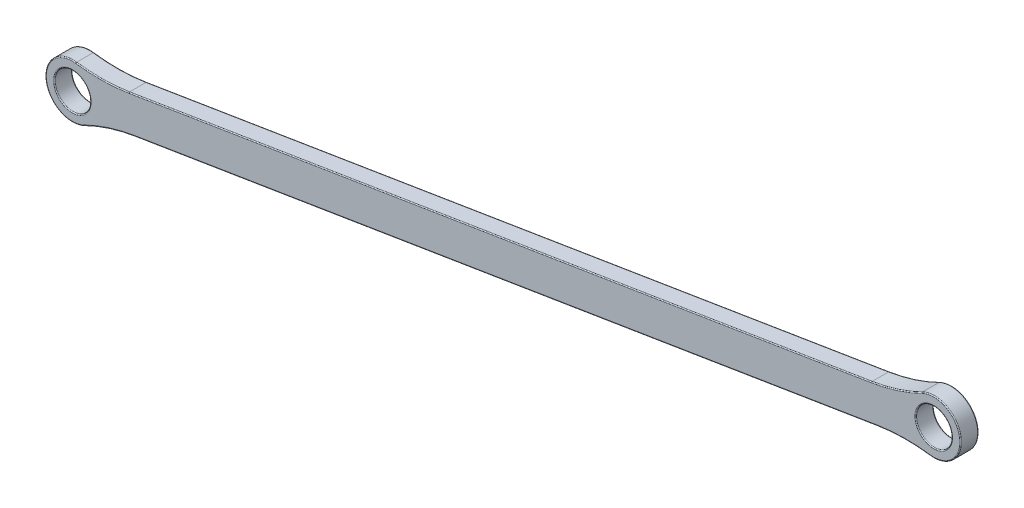
ISO-10303-21;
HEADER;
FILE_DESCRIPTION(('STEP AP214'),'2;1');
FILE_NAME('part.step','',(''),(''),'','','');
FILE_SCHEMA(('AUTOMOTIVE_DESIGN { 1 0 10303 214 1 1 1 1 }'));
ENDSEC;
DATA;
#1=APPLICATION_CONTEXT('core data for automotive mechanical design processes');
#2=APPLICATION_PROTOCOL_DEFINITION('international standard','automotive_design',2000,#1);
#3=PRODUCT_CONTEXT('',#1,'mechanical');
#4=PRODUCT('Part','Part','',(#3));
#5=PRODUCT_RELATED_PRODUCT_CATEGORY('part','',(#4));
#6=PRODUCT_DEFINITION_FORMATION('','',#4);
#7=PRODUCT_DEFINITION_CONTEXT('part definition',#1,'design');
#8=PRODUCT_DEFINITION('design','',#6,#7);
#9=PRODUCT_DEFINITION_SHAPE('','',#8);
#10=(LENGTH_UNIT() NAMED_UNIT(*) SI_UNIT(.MILLI.,.METRE.));
#11=(NAMED_UNIT(*) PLANE_ANGLE_UNIT() SI_UNIT($,.RADIAN.));
#12=(NAMED_UNIT(*) SI_UNIT($,.STERADIAN.) SOLID_ANGLE_UNIT());
#13=UNCERTAINTY_MEASURE_WITH_UNIT(LENGTH_MEASURE(1.E-05),#10,'distance_accuracy_value','');
#14=(GEOMETRIC_REPRESENTATION_CONTEXT(3) GLOBAL_UNCERTAINTY_ASSIGNED_CONTEXT((#13)) GLOBAL_UNIT_ASSIGNED_CONTEXT((#10,
#11,#12)) REPRESENTATION_CONTEXT('',''));
#15=CARTESIAN_POINT('',(0.,0.,0.));
#16=DIRECTION('',(0.,0.,1.));
#17=DIRECTION('',(1.,0.,0.));
#18=AXIS2_PLACEMENT_3D('',#15,#16,#17);
#19=CARTESIAN_POINT('',(-230.903241516904,202.906659724534,-3.));
#20=DIRECTION('',(0.,0.,1.));
#21=DIRECTION('',(1.,0.,0.));
#22=AXIS2_PLACEMENT_3D('',#19,#20,#21);
#23=CYLINDRICAL_SURFACE('',#22,4.49999999999999);
#24=DIRECTION('',(0.,0.,1.));
#25=VECTOR('',#24,1.);
#26=CARTESIAN_POINT('',(-230.297629891153,207.365721796175,-3.));
#27=LINE('',#26,#25);
#28=CARTESIAN_POINT('',(-230.297629891153,207.365721796175,-0.15));
#29=VERTEX_POINT('',#28);
#30=CARTESIAN_POINT('',(-230.297629891153,207.365721796175,-2.85));
#31=VERTEX_POINT('',#30);
#32=EDGE_CURVE('E305',#29,#31,#27,.F.);
#33=ORIENTED_EDGE('',*,*,#32,.T.);
#34=CARTESIAN_POINT('',(-230.903241516904,202.906659724534,-2.85));
#35=DIRECTION('',(0.,0.,1.));
#36=DIRECTION('',(1.,0.,0.));
#37=AXIS2_PLACEMENT_3D('',#34,#35,#36);
#38=CIRCLE('',#37,4.49999999999999);
#39=CARTESIAN_POINT('',(-228.9178396338,198.868321036092,-2.85));
#40=VERTEX_POINT('',#39);
#41=EDGE_CURVE('E220',#31,#40,#38,.T.);
#42=ORIENTED_EDGE('',*,*,#41,.T.);
#43=DIRECTION('',(0.,0.,1.));
#44=VECTOR('',#43,1.);
#45=CARTESIAN_POINT('',(-228.9178396338,198.868321036092,-3.));
#46=LINE('',#45,#44);
#47=CARTESIAN_POINT('',(-228.9178396338,198.868321036092,-0.15));
#48=VERTEX_POINT('',#47);
#49=EDGE_CURVE('E299',#40,#48,#46,.T.);
#50=ORIENTED_EDGE('',*,*,#49,.T.);
#51=CARTESIAN_POINT('',(-230.903241516904,202.906659724534,-0.15));
#52=DIRECTION('',(0.,0.,1.));
#53=DIRECTION('',(1.,0.,0.));
#54=AXIS2_PLACEMENT_3D('',#51,#52,#53);
#55=CIRCLE('',#54,4.49999999999999);
#56=EDGE_CURVE('E218',#48,#29,#55,.F.);
#57=ORIENTED_EDGE('',*,*,#56,.T.);
#58=EDGE_LOOP('',(#33,#42,#50,#57));
#59=FACE_BOUND('',#58,.T.);
#60=ADVANCED_FACE('F34',(#59),#23,.T.);
#61=CARTESIAN_POINT('',(-38.5137304043666,237.185760855667,-3.));
#62=DIRECTION('',(0.16027866625828,-0.987071805464256,0.));
#63=DIRECTION('',(0.987071805464256,0.16027866625828,0.));
#64=AXIS2_PLACEMENT_3D('',#61,#62,#63);
#65=PLANE('',#64);
#66=DIRECTION('',(0.,0.,1.));
#67=VECTOR('',#66,1.);
#68=CARTESIAN_POINT('',(-97.2038123685089,227.655787445701,-3.));
#69=LINE('',#68,#67);
#70=CARTESIAN_POINT('',(-97.2038123685089,227.655787445701,-0.15));
#71=VERTEX_POINT('',#70);
#72=CARTESIAN_POINT('',(-97.2038123685089,227.655787445701,-2.85));
#73=VERTEX_POINT('',#72);
#74=EDGE_CURVE('E333',#71,#73,#69,.F.);
#75=ORIENTED_EDGE('',*,*,#74,.T.);
#76=DIRECTION('',(0.987071805464256,0.16027866625828,0.));
#77=VECTOR('',#76,1.);
#78=CARTESIAN_POINT('',(-38.5137304043666,237.185760855667,-2.85));
#79=LINE('',#78,#77);
#80=CARTESIAN_POINT('',(-221.451859065067,207.480648109861,-2.85));
#81=VERTEX_POINT('',#80);
#82=EDGE_CURVE('E212',#73,#81,#79,.F.);
#83=ORIENTED_EDGE('',*,*,#82,.T.);
#84=DIRECTION('',(0.,0.,1.));
#85=VECTOR('',#84,1.);
#86=CARTESIAN_POINT('',(-221.451859065067,207.480648109861,-3.));
#87=LINE('',#86,#85);
#88=CARTESIAN_POINT('',(-221.451859065067,207.480648109861,-0.15));
#89=VERTEX_POINT('',#88);
#90=EDGE_CURVE('E336',#81,#89,#87,.T.);
#91=ORIENTED_EDGE('',*,*,#90,.T.);
#92=DIRECTION('',(0.987071805464256,0.16027866625828,0.));
#93=VECTOR('',#92,1.);
#94=CARTESIAN_POINT('',(-97.203812368509,227.655787445701,-0.15));
#95=LINE('',#94,#93);
#96=EDGE_CURVE('E210',#89,#71,#95,.T.);
#97=ORIENTED_EDGE('',*,*,#96,.T.);
#98=EDGE_LOOP('',(#75,#83,#91,#97));
#99=FACE_BOUND('',#98,.T.);
#100=ADVANCED_FACE('F367',(#99),#65,.F.);
#101=CARTESIAN_POINT('',(-86.7907579191226,226.307344998242,-3.));
#102=DIRECTION('',(0.,0.,1.));
#103=DIRECTION('',(1.,0.,0.));
#104=AXIS2_PLACEMENT_3D('',#101,#102,#103);
#105=CYLINDRICAL_SURFACE('',#104,4.50000000000001);
#106=DIRECTION('',(0.,0.,1.));
#107=VECTOR('',#106,1.);
#108=CARTESIAN_POINT('',(-87.3963695448733,221.8482829266,-3.));
#109=LINE('',#108,#107);
#110=CARTESIAN_POINT('',(-87.3963695448733,221.8482829266,-0.15));
#111=VERTEX_POINT('',#110);
#112=CARTESIAN_POINT('',(-87.3963695448733,221.8482829266,-2.85));
#113=VERTEX_POINT('',#112);
#114=EDGE_CURVE('E261',#111,#113,#109,.F.);
#115=ORIENTED_EDGE('',*,*,#114,.T.);
#116=CARTESIAN_POINT('',(-86.7907579191226,226.307344998242,-2.85));
#117=DIRECTION('',(0.,0.,1.));
#118=DIRECTION('',(1.,0.,0.));
#119=AXIS2_PLACEMENT_3D('',#116,#117,#118);
#120=CIRCLE('',#119,4.50000000000001);
#121=CARTESIAN_POINT('',(-88.7761598022272,230.345683686684,-2.85));
#122=VERTEX_POINT('',#121);
#123=EDGE_CURVE('E203',#113,#122,#120,.T.);
#124=ORIENTED_EDGE('',*,*,#123,.T.);
#125=DIRECTION('',(0.,0.,1.));
#126=VECTOR('',#125,1.);
#127=CARTESIAN_POINT('',(-88.7761598022272,230.345683686684,-3.));
#128=LINE('',#127,#126);
#129=CARTESIAN_POINT('',(-88.7761598022272,230.345683686684,-0.15));
#130=VERTEX_POINT('',#129);
#131=EDGE_CURVE('E341',#122,#130,#128,.T.);
#132=ORIENTED_EDGE('',*,*,#131,.T.);
#133=CARTESIAN_POINT('',(-86.7907579191226,226.307344998242,-0.15));
#134=DIRECTION('',(0.,0.,1.));
#135=DIRECTION('',(1.,0.,0.));
#136=AXIS2_PLACEMENT_3D('',#133,#134,#135);
#137=CIRCLE('',#136,4.50000000000001);
#138=EDGE_CURVE('E201',#130,#111,#137,.F.);
#139=ORIENTED_EDGE('',*,*,#138,.T.);
#140=EDGE_LOOP('',(#115,#124,#132,#139));
#141=FACE_BOUND('',#140,.T.);
#142=ADVANCED_FACE('F348',(#141),#105,.T.);
#143=CARTESIAN_POINT('',(-37.5520584068169,231.263330022882,-3.));
#144=DIRECTION('',(0.16027866625828,-0.987071805464256,0.));
#145=DIRECTION('',(0.987071805464256,0.16027866625828,0.));
#146=AXIS2_PLACEMENT_3D('',#143,#144,#145);
#147=PLANE('',#146);
#148=DIRECTION('',(0.,0.,-1.));
#149=VECTOR('',#148,1.);
#150=CARTESIAN_POINT('',(-220.490187067517,201.558217277075,-3.));
#151=LINE('',#150,#149);
#152=CARTESIAN_POINT('',(-220.490187067517,201.558217277075,-0.15));
#153=VERTEX_POINT('',#152);
#154=CARTESIAN_POINT('',(-220.490187067517,201.558217277075,-2.85));
#155=VERTEX_POINT('',#154);
#156=EDGE_CURVE('E301',#153,#155,#151,.T.);
#157=ORIENTED_EDGE('',*,*,#156,.T.);
#158=DIRECTION('',(0.987071805464256,0.16027866625828,0.));
#159=VECTOR('',#158,1.);
#160=CARTESIAN_POINT('',(-96.2421403709596,221.733356612915,-2.85));
#161=LINE('',#160,#159);
#162=CARTESIAN_POINT('',(-96.2421403709596,221.733356612915,-2.85));
#163=VERTEX_POINT('',#162);
#164=EDGE_CURVE('E195',#155,#163,#161,.T.);
#165=ORIENTED_EDGE('',*,*,#164,.T.);
#166=DIRECTION('',(0.,0.,-1.));
#167=VECTOR('',#166,1.);
#168=CARTESIAN_POINT('',(-96.2421403709596,221.733356612915,0.));
#169=LINE('',#168,#167);
#170=CARTESIAN_POINT('',(-96.2421403709596,221.733356612915,-0.15));
#171=VERTEX_POINT('',#170);
#172=EDGE_CURVE('E309',#163,#171,#169,.F.);
#173=ORIENTED_EDGE('',*,*,#172,.T.);
#174=DIRECTION('',(0.987071805464256,0.16027866625828,0.));
#175=VECTOR('',#174,1.);
#176=CARTESIAN_POINT('',(-37.5520584068169,231.263330022882,-0.15));
#177=LINE('',#176,#175);
#178=EDGE_CURVE('E193',#171,#153,#177,.F.);
#179=ORIENTED_EDGE('',*,*,#178,.T.);
#180=EDGE_LOOP('',(#157,#165,#173,#179));
#181=FACE_BOUND('',#180,.T.);
#182=ADVANCED_FACE('F332',(#181),#147,.T.);
#183=CARTESIAN_POINT('',(-86.7907579191226,226.307344998242,-3.));
#184=DIRECTION('',(0.,0.,1.));
#185=DIRECTION('',(1.,0.,0.));
#186=AXIS2_PLACEMENT_3D('',#183,#184,#185);
#187=CYLINDRICAL_SURFACE('',#186,3.00000000000005);
#188=CARTESIAN_POINT('',(-86.7907579191226,226.307344998242,-2.85));
#189=DIRECTION('',(0.,0.,1.));
#190=DIRECTION('',(1.,0.,0.));
#191=AXIS2_PLACEMENT_3D('',#188,#189,#190);
#192=CIRCLE('',#191,3.00000000000005);
#193=CARTESIAN_POINT('',(-83.7907579191226,226.307344998242,-2.85));
#194=VERTEX_POINT('',#193);
#195=EDGE_CURVE('E225',#194,#194,#192,.F.);
#196=ORIENTED_EDGE('',*,*,#195,.T.);
#197=EDGE_LOOP('',(#196));
#198=FACE_BOUND('',#197,.T.);
#199=CARTESIAN_POINT('',(-86.7907579191226,226.307344998242,-0.15));
#200=DIRECTION('',(0.,0.,1.));
#201=DIRECTION('',(1.,0.,0.));
#202=AXIS2_PLACEMENT_3D('',#199,#200,#201);
#203=CIRCLE('',#202,3.00000000000005);
#204=CARTESIAN_POINT('',(-83.7907579191226,226.307344998242,-0.15));
#205=VERTEX_POINT('',#204);
#206=EDGE_CURVE('E222',#205,#205,#203,.T.);
#207=ORIENTED_EDGE('',*,*,#206,.T.);
#208=EDGE_LOOP('',(#207));
#209=FACE_BOUND('',#208,.T.);
#210=ADVANCED_FACE('F402',(#198,#209),#187,.F.);
#211=CARTESIAN_POINT('',(-230.903241516904,202.906659724534,-3.));
#212=DIRECTION('',(0.,0.,1.));
#213=DIRECTION('',(1.,0.,0.));
#214=AXIS2_PLACEMENT_3D('',#211,#212,#213);
#215=CYLINDRICAL_SURFACE('',#214,3.00000000000004);
#216=CARTESIAN_POINT('',(-230.903241516904,202.906659724534,-2.85));
#217=DIRECTION('',(0.,0.,1.));
#218=DIRECTION('',(1.,0.,0.));
#219=AXIS2_PLACEMENT_3D('',#216,#217,#218);
#220=CIRCLE('',#219,3.00000000000004);
#221=CARTESIAN_POINT('',(-227.903241516904,202.906659724534,-2.85));
#222=VERTEX_POINT('',#221);
#223=EDGE_CURVE('E187',#222,#222,#220,.F.);
#224=ORIENTED_EDGE('',*,*,#223,.T.);
#225=EDGE_LOOP('',(#224));
#226=FACE_BOUND('',#225,.T.);
#227=CARTESIAN_POINT('',(-230.903241516904,202.906659724534,-0.15));
#228=DIRECTION('',(0.,0.,1.));
#229=DIRECTION('',(1.,0.,0.));
#230=AXIS2_PLACEMENT_3D('',#227,#228,#229);
#231=CIRCLE('',#230,3.00000000000004);
#232=CARTESIAN_POINT('',(-227.903241516904,202.906659724534,-0.15));
#233=VERTEX_POINT('',#232);
#234=EDGE_CURVE('E179',#233,#233,#231,.T.);
#235=ORIENTED_EDGE('',*,*,#234,.T.);
#236=EDGE_LOOP('',(#235));
#237=FACE_BOUND('',#236,.T.);
#238=ADVANCED_FACE('F404',(#226,#237),#215,.F.);
#239=CARTESIAN_POINT('',(0.,0.,-3.));
#240=DIRECTION('',(0.,0.,1.));
#241=DIRECTION('',(1.,0.,0.));
#242=AXIS2_PLACEMENT_3D('',#239,#240,#241);
#243=PLANE('',#242);
#244=CARTESIAN_POINT('',(-230.903241516904,202.906659724534,-3.));
#245=DIRECTION('',(0.,0.,1.));
#246=DIRECTION('',(1.,0.,0.));
#247=AXIS2_PLACEMENT_3D('',#244,#245,#246);
#248=CIRCLE('',#247,3.15000000000004);
#249=CARTESIAN_POINT('',(-227.753241516904,202.906659724534,-3.));
#250=VERTEX_POINT('',#249);
#251=EDGE_CURVE('E176',#250,#250,#248,.T.);
#252=ORIENTED_EDGE('',*,*,#251,.T.);
#253=EDGE_LOOP('',(#252));
#254=FACE_BOUND('',#253,.T.);
#255=DIRECTION('',(0.987071805464256,0.16027866625828,0.));
#256=VECTOR('',#255,1.);
#257=CARTESIAN_POINT('',(-220.514228867456,201.706278047895,-3.));
#258=LINE('',#257,#256);
#259=CARTESIAN_POINT('',(-96.2661821708984,221.881417383735,-3.));
#260=VERTEX_POINT('',#259);
#261=CARTESIAN_POINT('',(-220.514228867456,201.706278047895,-3.));
#262=VERTEX_POINT('',#261);
#263=EDGE_CURVE('E174',#260,#262,#258,.F.);
#264=ORIENTED_EDGE('',*,*,#263,.T.);
#265=CARTESIAN_POINT('',(-215.681827079769,171.946063113147,-3.));
#266=DIRECTION('',(0.,0.,1.));
#267=DIRECTION('',(1.,0.,0.));
#268=AXIS2_PLACEMENT_3D('',#265,#266,#267);
#269=CIRCLE('',#268,30.15);
#270=CARTESIAN_POINT('',(-228.98401969657,199.002932325707,-3.));
#271=VERTEX_POINT('',#270);
#272=EDGE_CURVE('E154',#262,#271,#269,.T.);
#273=ORIENTED_EDGE('',*,*,#272,.T.);
#274=CARTESIAN_POINT('',(-230.903241516904,202.906659724534,-3.));
#275=DIRECTION('',(0.,0.,1.));
#276=DIRECTION('',(1.,0.,0.));
#277=AXIS2_PLACEMENT_3D('',#274,#275,#276);
#278=CIRCLE('',#277,4.34999999999999);
#279=CARTESIAN_POINT('',(-230.317816945345,207.217086393787,-3.));
#280=VERTEX_POINT('',#279);
#281=EDGE_CURVE('E162',#271,#280,#278,.F.);
#282=ORIENTED_EDGE('',*,*,#281,.T.);
#283=CARTESIAN_POINT('',(-226.260219052816,237.092802273788,-3.));
#284=DIRECTION('',(0.,0.,1.));
#285=DIRECTION('',(1.,0.,0.));
#286=AXIS2_PLACEMENT_3D('',#283,#284,#285);
#287=CIRCLE('',#286,30.15);
#288=CARTESIAN_POINT('',(-221.427817265129,207.332587339041,-3.));
#289=VERTEX_POINT('',#288);
#290=EDGE_CURVE('E168',#280,#289,#287,.T.);
#291=ORIENTED_EDGE('',*,*,#290,.T.);
#292=DIRECTION('',(0.987071805464256,0.16027866625828,0.));
#293=VECTOR('',#292,1.);
#294=CARTESIAN_POINT('',(-38.4896886044279,237.037700084848,-3.));
#295=LINE('',#294,#293);
#296=CARTESIAN_POINT('',(-97.1797705685702,227.507726674881,-3.));
#297=VERTEX_POINT('',#296);
#298=EDGE_CURVE('E314',#289,#297,#295,.T.);
#299=ORIENTED_EDGE('',*,*,#298,.T.);
#300=CARTESIAN_POINT('',(-102.012172356257,257.267941609629,-3.));
#301=DIRECTION('',(0.,0.,1.));
#302=DIRECTION('',(1.,0.,0.));
#303=AXIS2_PLACEMENT_3D('',#300,#301,#302);
#304=CIRCLE('',#303,30.15);
#305=CARTESIAN_POINT('',(-88.709979739457,230.211072397069,-3.));
#306=VERTEX_POINT('',#305);
#307=EDGE_CURVE('E316',#297,#306,#304,.T.);
#308=ORIENTED_EDGE('',*,*,#307,.T.);
#309=CARTESIAN_POINT('',(-86.7907579191226,226.307344998242,-3.));
#310=DIRECTION('',(0.,0.,1.));
#311=DIRECTION('',(1.,0.,0.));
#312=AXIS2_PLACEMENT_3D('',#309,#310,#311);
#313=CIRCLE('',#312,4.35000000000001);
#314=CARTESIAN_POINT('',(-87.3761824906816,221.996918328989,-3.));
#315=VERTEX_POINT('',#314);
#316=EDGE_CURVE('E318',#306,#315,#313,.F.);
#317=ORIENTED_EDGE('',*,*,#316,.T.);
#318=CARTESIAN_POINT('',(-91.4337803832112,192.121202448988,-3.));
#319=DIRECTION('',(0.,0.,1.));
#320=DIRECTION('',(1.,0.,0.));
#321=AXIS2_PLACEMENT_3D('',#318,#319,#320);
#322=CIRCLE('',#321,30.15);
#323=EDGE_CURVE('E181',#315,#260,#322,.T.);
#324=ORIENTED_EDGE('',*,*,#323,.T.);
#325=EDGE_LOOP('',(#264,#273,#282,#291,#299,#308,#317,#324));
#326=FACE_BOUND('',#325,.T.);
#327=CARTESIAN_POINT('',(-86.7907579191226,226.307344998242,-3.));
#328=DIRECTION('',(0.,0.,1.));
#329=DIRECTION('',(1.,0.,0.));
#330=AXIS2_PLACEMENT_3D('',#327,#328,#329);
#331=CIRCLE('',#330,3.15000000000005);
#332=CARTESIAN_POINT('',(-83.6407579191226,226.307344998242,-3.));
#333=VERTEX_POINT('',#332);
#334=EDGE_CURVE('E169',#333,#333,#331,.T.);
#335=ORIENTED_EDGE('',*,*,#334,.T.);
#336=EDGE_LOOP('',(#335));
#337=FACE_BOUND('',#336,.T.);
#338=ADVANCED_FACE('F171',(#254,#326,#337),#243,.F.);
#339=CARTESIAN_POINT('',(0.,0.,0.));
#340=DIRECTION('',(0.,0.,1.));
#341=DIRECTION('',(1.,0.,0.));
#342=AXIS2_PLACEMENT_3D('',#339,#340,#341);
#343=PLANE('',#342);
#344=CARTESIAN_POINT('',(-230.903241516904,202.906659724534,0.));
#345=DIRECTION('',(0.,0.,1.));
#346=DIRECTION('',(1.,0.,0.));
#347=AXIS2_PLACEMENT_3D('',#344,#345,#346);
#348=CIRCLE('',#347,3.15000000000004);
#349=CARTESIAN_POINT('',(-227.753241516904,202.906659724534,0.));
#350=VERTEX_POINT('',#349);
#351=EDGE_CURVE('E11',#350,#350,#348,.F.);
#352=ORIENTED_EDGE('',*,*,#351,.T.);
#353=EDGE_LOOP('',(#352));
#354=FACE_BOUND('',#353,.T.);
#355=CARTESIAN_POINT('',(-86.7907579191226,226.307344998242,0.));
#356=DIRECTION('',(0.,0.,1.));
#357=DIRECTION('',(1.,0.,0.));
#358=AXIS2_PLACEMENT_3D('',#355,#356,#357);
#359=CIRCLE('',#358,4.35000000000001);
#360=CARTESIAN_POINT('',(-87.3761824906816,221.996918328989,0.));
#361=VERTEX_POINT('',#360);
#362=CARTESIAN_POINT('',(-88.709979739457,230.211072397069,0.));
#363=VERTEX_POINT('',#362);
#364=EDGE_CURVE('E51',#361,#363,#359,.T.);
#365=ORIENTED_EDGE('',*,*,#364,.T.);
#366=CARTESIAN_POINT('',(-102.012172356257,257.267941609629,0.));
#367=DIRECTION('',(0.,0.,1.));
#368=DIRECTION('',(1.,0.,0.));
#369=AXIS2_PLACEMENT_3D('',#366,#367,#368);
#370=CIRCLE('',#369,30.15);
#371=CARTESIAN_POINT('',(-97.1797705685702,227.507726674881,0.));
#372=VERTEX_POINT('',#371);
#373=EDGE_CURVE('E43',#363,#372,#370,.F.);
#374=ORIENTED_EDGE('',*,*,#373,.T.);
#375=DIRECTION('',(0.987071805464256,0.16027866625828,0.));
#376=VECTOR('',#375,1.);
#377=CARTESIAN_POINT('',(-221.427817265129,207.332587339041,0.));
#378=LINE('',#377,#376);
#379=CARTESIAN_POINT('',(-221.427817265129,207.332587339041,0.));
#380=VERTEX_POINT('',#379);
#381=EDGE_CURVE('E231',#372,#380,#378,.F.);
#382=ORIENTED_EDGE('',*,*,#381,.T.);
#383=CARTESIAN_POINT('',(-226.260219052816,237.092802273788,0.));
#384=DIRECTION('',(0.,0.,1.));
#385=DIRECTION('',(1.,0.,0.));
#386=AXIS2_PLACEMENT_3D('',#383,#384,#385);
#387=CIRCLE('',#386,30.15);
#388=CARTESIAN_POINT('',(-230.317816945345,207.217086393787,0.));
#389=VERTEX_POINT('',#388);
#390=EDGE_CURVE('E233',#380,#389,#387,.F.);
#391=ORIENTED_EDGE('',*,*,#390,.T.);
#392=CARTESIAN_POINT('',(-230.903241516904,202.906659724534,0.));
#393=DIRECTION('',(0.,0.,1.));
#394=DIRECTION('',(1.,0.,0.));
#395=AXIS2_PLACEMENT_3D('',#392,#393,#394);
#396=CIRCLE('',#395,4.34999999999999);
#397=CARTESIAN_POINT('',(-228.98401969657,199.002932325707,0.));
#398=VERTEX_POINT('',#397);
#399=EDGE_CURVE('E235',#389,#398,#396,.T.);
#400=ORIENTED_EDGE('',*,*,#399,.T.);
#401=CARTESIAN_POINT('',(-215.681827079769,171.946063113147,0.));
#402=DIRECTION('',(0.,0.,1.));
#403=DIRECTION('',(1.,0.,0.));
#404=AXIS2_PLACEMENT_3D('',#401,#402,#403);
#405=CIRCLE('',#404,30.15);
#406=CARTESIAN_POINT('',(-220.514228867456,201.706278047895,0.));
#407=VERTEX_POINT('',#406);
#408=EDGE_CURVE('E237',#398,#407,#405,.F.);
#409=ORIENTED_EDGE('',*,*,#408,.T.);
#410=DIRECTION('',(0.987071805464256,0.16027866625828,0.));
#411=VECTOR('',#410,1.);
#412=CARTESIAN_POINT('',(-37.5761002067556,231.411390793701,0.));
#413=LINE('',#412,#411);
#414=CARTESIAN_POINT('',(-96.2661821708984,221.881417383735,0.));
#415=VERTEX_POINT('',#414);
#416=EDGE_CURVE('E239',#407,#415,#413,.T.);
#417=ORIENTED_EDGE('',*,*,#416,.T.);
#418=CARTESIAN_POINT('',(-91.4337803832112,192.121202448988,0.));
#419=DIRECTION('',(0.,0.,1.));
#420=DIRECTION('',(1.,0.,0.));
#421=AXIS2_PLACEMENT_3D('',#418,#419,#420);
#422=CIRCLE('',#421,30.15);
#423=EDGE_CURVE('E56',#415,#361,#422,.F.);
#424=ORIENTED_EDGE('',*,*,#423,.T.);
#425=EDGE_LOOP('',(#365,#374,#382,#391,#400,#409,#417,#424));
#426=FACE_BOUND('',#425,.T.);
#427=CARTESIAN_POINT('',(-86.7907579191226,226.307344998242,0.));
#428=DIRECTION('',(0.,0.,1.));
#429=DIRECTION('',(1.,0.,0.));
#430=AXIS2_PLACEMENT_3D('',#427,#428,#429);
#431=CIRCLE('',#430,3.15000000000005);
#432=CARTESIAN_POINT('',(-83.6407579191226,226.307344998242,0.));
#433=VERTEX_POINT('',#432);
#434=EDGE_CURVE('E228',#433,#433,#431,.F.);
#435=ORIENTED_EDGE('',*,*,#434,.T.);
#436=EDGE_LOOP('',(#435));
#437=FACE_BOUND('',#436,.T.);
#438=ADVANCED_FACE('F391',(#354,#426,#437),#343,.T.);
#439=CARTESIAN_POINT('',(-102.012172356257,257.267941609629,-3.));
#440=DIRECTION('',(0.,0.,1.));
#441=DIRECTION('',(1.,0.,0.));
#442=AXIS2_PLACEMENT_3D('',#439,#440,#441);
#443=CYLINDRICAL_SURFACE('',#442,30.);
#444=ORIENTED_EDGE('',*,*,#131,.F.);
#445=CARTESIAN_POINT('',(-102.012172356257,257.267941609629,-2.85));
#446=DIRECTION('',(0.,0.,1.));
#447=DIRECTION('',(1.,0.,0.));
#448=AXIS2_PLACEMENT_3D('',#445,#446,#447);
#449=CIRCLE('',#448,30.);
#450=EDGE_CURVE('E208',#122,#73,#449,.F.);
#451=ORIENTED_EDGE('',*,*,#450,.T.);
#452=ORIENTED_EDGE('',*,*,#74,.F.);
#453=CARTESIAN_POINT('',(-102.012172356257,257.267941609629,-0.15));
#454=DIRECTION('',(0.,0.,1.));
#455=DIRECTION('',(1.,0.,0.));
#456=AXIS2_PLACEMENT_3D('',#453,#454,#455);
#457=CIRCLE('',#456,30.);
#458=EDGE_CURVE('E205',#71,#130,#457,.T.);
#459=ORIENTED_EDGE('',*,*,#458,.T.);
#460=EDGE_LOOP('',(#444,#451,#452,#459));
#461=FACE_BOUND('',#460,.T.);
#462=ADVANCED_FACE('F364',(#461),#443,.F.);
#463=CARTESIAN_POINT('',(-91.4337803832112,192.121202448988,-3.));
#464=DIRECTION('',(0.,0.,1.));
#465=DIRECTION('',(1.,0.,0.));
#466=AXIS2_PLACEMENT_3D('',#463,#464,#465);
#467=CYLINDRICAL_SURFACE('',#466,30.);
#468=ORIENTED_EDGE('',*,*,#172,.F.);
#469=CARTESIAN_POINT('',(-91.4337803832112,192.121202448988,-2.85));
#470=DIRECTION('',(0.,0.,1.));
#471=DIRECTION('',(1.,0.,0.));
#472=AXIS2_PLACEMENT_3D('',#469,#470,#471);
#473=CIRCLE('',#472,30.);
#474=EDGE_CURVE('E199',#163,#113,#473,.F.);
#475=ORIENTED_EDGE('',*,*,#474,.T.);
#476=ORIENTED_EDGE('',*,*,#114,.F.);
#477=CARTESIAN_POINT('',(-91.4337803832112,192.121202448988,-0.15));
#478=DIRECTION('',(0.,0.,1.));
#479=DIRECTION('',(1.,0.,0.));
#480=AXIS2_PLACEMENT_3D('',#477,#478,#479);
#481=CIRCLE('',#480,30.);
#482=EDGE_CURVE('E197',#111,#171,#481,.T.);
#483=ORIENTED_EDGE('',*,*,#482,.T.);
#484=EDGE_LOOP('',(#468,#475,#476,#483));
#485=FACE_BOUND('',#484,.T.);
#486=ADVANCED_FACE('F382',(#485),#467,.F.);
#487=CARTESIAN_POINT('',(-215.681827079769,171.946063113147,-3.));
#488=DIRECTION('',(0.,0.,1.));
#489=DIRECTION('',(1.,0.,0.));
#490=AXIS2_PLACEMENT_3D('',#487,#488,#489);
#491=CYLINDRICAL_SURFACE('',#490,30.);
#492=ORIENTED_EDGE('',*,*,#49,.F.);
#493=CARTESIAN_POINT('',(-215.681827079769,171.946063113147,-2.85));
#494=DIRECTION('',(0.,0.,1.));
#495=DIRECTION('',(1.,0.,0.));
#496=AXIS2_PLACEMENT_3D('',#493,#494,#495);
#497=CIRCLE('',#496,30.);
#498=EDGE_CURVE('E156',#40,#155,#497,.F.);
#499=ORIENTED_EDGE('',*,*,#498,.T.);
#500=ORIENTED_EDGE('',*,*,#156,.F.);
#501=CARTESIAN_POINT('',(-215.681827079769,171.946063113147,-0.15));
#502=DIRECTION('',(0.,0.,1.));
#503=DIRECTION('',(1.,0.,0.));
#504=AXIS2_PLACEMENT_3D('',#501,#502,#503);
#505=CIRCLE('',#504,30.);
#506=EDGE_CURVE('E190',#153,#48,#505,.T.);
#507=ORIENTED_EDGE('',*,*,#506,.T.);
#508=EDGE_LOOP('',(#492,#499,#500,#507));
#509=FACE_BOUND('',#508,.T.);
#510=ADVANCED_FACE('F298',(#509),#491,.F.);
#511=CARTESIAN_POINT('',(-226.260219052816,237.092802273788,-3.));
#512=DIRECTION('',(0.,0.,1.));
#513=DIRECTION('',(1.,0.,0.));
#514=AXIS2_PLACEMENT_3D('',#511,#512,#513);
#515=CYLINDRICAL_SURFACE('',#514,30.);
#516=ORIENTED_EDGE('',*,*,#90,.F.);
#517=CARTESIAN_POINT('',(-226.260219052816,237.092802273788,-2.85));
#518=DIRECTION('',(0.,0.,1.));
#519=DIRECTION('',(1.,0.,0.));
#520=AXIS2_PLACEMENT_3D('',#517,#518,#519);
#521=CIRCLE('',#520,30.);
#522=EDGE_CURVE('E216',#81,#31,#521,.F.);
#523=ORIENTED_EDGE('',*,*,#522,.T.);
#524=ORIENTED_EDGE('',*,*,#32,.F.);
#525=CARTESIAN_POINT('',(-226.260219052816,237.092802273788,-0.15));
#526=DIRECTION('',(0.,0.,1.));
#527=DIRECTION('',(1.,0.,0.));
#528=AXIS2_PLACEMENT_3D('',#525,#526,#527);
#529=CIRCLE('',#528,30.);
#530=EDGE_CURVE('E214',#29,#89,#529,.T.);
#531=ORIENTED_EDGE('',*,*,#530,.T.);
#532=EDGE_LOOP('',(#516,#523,#524,#531));
#533=FACE_BOUND('',#532,.T.);
#534=ADVANCED_FACE('F389',(#533),#515,.F.);
#535=CARTESIAN_POINT('',(-230.903241516904,202.906659724534,-2.85));
#536=DIRECTION('',(0.,0.,1.));
#537=DIRECTION('',(1.,0.,0.));
#538=AXIS2_PLACEMENT_3D('',#535,#536,#537);
#539=TOROIDAL_SURFACE('',#538,3.15000000000004,0.15);
#540=ORIENTED_EDGE('',*,*,#223,.F.);
#541=EDGE_LOOP('',(#540));
#542=FACE_BOUND('',#541,.T.);
#543=ORIENTED_EDGE('',*,*,#251,.F.);
#544=EDGE_LOOP('',(#543));
#545=FACE_BOUND('',#544,.T.);
#546=ADVANCED_FACE('F492',(#542,#545),#539,.T.);
#547=CARTESIAN_POINT('',(-102.012172356257,257.267941609629,-2.85));
#548=DIRECTION('',(0.,0.,1.));
#549=DIRECTION('',(1.,0.,0.));
#550=AXIS2_PLACEMENT_3D('',#547,#548,#549);
#551=TOROIDAL_SURFACE('',#550,30.15,0.15);
#552=CARTESIAN_POINT('',(-97.1797705685702,227.507726674881,-2.85));
#553=DIRECTION('',(-0.987071805464255,-0.160278666258287,0.));
#554=DIRECTION('',(0.160278666258287,-0.987071805464255,0.));
#555=AXIS2_PLACEMENT_3D('',#552,#553,#554);
#556=CIRCLE('',#555,0.15);
#557=EDGE_CURVE('E255',#73,#297,#556,.T.);
#558=ORIENTED_EDGE('',*,*,#557,.F.);
#559=ORIENTED_EDGE('',*,*,#450,.F.);
#560=CARTESIAN_POINT('',(-88.709979739457,230.211072397069,-2.85));
#561=DIRECTION('',(0.897408597431498,0.441200418467652,0.));
#562=DIRECTION('',(-0.441200418467652,0.897408597431498,0.));
#563=AXIS2_PLACEMENT_3D('',#560,#561,#562);
#564=CIRCLE('',#563,0.15);
#565=EDGE_CURVE('E258',#306,#122,#564,.T.);
#566=ORIENTED_EDGE('',*,*,#565,.F.);
#567=ORIENTED_EDGE('',*,*,#307,.F.);
#568=EDGE_LOOP('',(#558,#559,#566,#567));
#569=FACE_BOUND('',#568,.T.);
#570=ADVANCED_FACE('F360',(#569),#551,.T.);
#571=CARTESIAN_POINT('',(-86.7907579191226,226.307344998242,-2.85));
#572=DIRECTION('',(0.,0.,1.));
#573=DIRECTION('',(1.,0.,0.));
#574=AXIS2_PLACEMENT_3D('',#571,#572,#573);
#575=TOROIDAL_SURFACE('',#574,4.35000000000001,0.15);
#576=ORIENTED_EDGE('',*,*,#565,.T.);
#577=ORIENTED_EDGE('',*,*,#123,.F.);
#578=CARTESIAN_POINT('',(-87.3761824906816,221.996918328989,-2.85));
#579=DIRECTION('',(-0.990902682587098,0.134580361277907,0.));
#580=DIRECTION('',(-0.134580361277907,-0.990902682587098,0.));
#581=AXIS2_PLACEMENT_3D('',#578,#579,#580);
#582=CIRCLE('',#581,0.15);
#583=EDGE_CURVE('E252',#315,#113,#582,.T.);
#584=ORIENTED_EDGE('',*,*,#583,.F.);
#585=ORIENTED_EDGE('',*,*,#316,.F.);
#586=EDGE_LOOP('',(#576,#577,#584,#585));
#587=FACE_BOUND('',#586,.T.);
#588=ADVANCED_FACE('F354',(#587),#575,.T.);
#589=CARTESIAN_POINT('',(-38.4896886044279,237.037700084848,-2.85));
#590=DIRECTION('',(0.987071805464256,0.16027866625828,0.));
#591=DIRECTION('',(-0.16027866625828,0.987071805464256,0.));
#592=AXIS2_PLACEMENT_3D('',#589,#590,#591);
#593=CYLINDRICAL_SURFACE('',#592,0.15);
#594=ORIENTED_EDGE('',*,*,#557,.T.);
#595=ORIENTED_EDGE('',*,*,#298,.F.);
#596=CARTESIAN_POINT('',(-221.427817265129,207.332587339041,-2.85));
#597=DIRECTION('',(-0.98707180546427,-0.160278666258197,0.));
#598=DIRECTION('',(0.160278666258197,-0.98707180546427,0.));
#599=AXIS2_PLACEMENT_3D('',#596,#597,#598);
#600=CIRCLE('',#599,0.15);
#601=EDGE_CURVE('E249',#81,#289,#600,.T.);
#602=ORIENTED_EDGE('',*,*,#601,.F.);
#603=ORIENTED_EDGE('',*,*,#82,.F.);
#604=EDGE_LOOP('',(#594,#595,#602,#603));
#605=FACE_BOUND('',#604,.T.);
#606=ADVANCED_FACE('F519',(#605),#593,.T.);
#607=CARTESIAN_POINT('',(-91.4337803832112,192.121202448988,-2.85));
#608=DIRECTION('',(0.,0.,1.));
#609=DIRECTION('',(1.,0.,0.));
#610=AXIS2_PLACEMENT_3D('',#607,#608,#609);
#611=TOROIDAL_SURFACE('',#610,30.15,0.15);
#612=ORIENTED_EDGE('',*,*,#583,.T.);
#613=ORIENTED_EDGE('',*,*,#474,.F.);
#614=CARTESIAN_POINT('',(-96.2661821708984,221.881417383735,-2.85));
#615=DIRECTION('',(-0.987071805464245,-0.160278666258348,0.));
#616=DIRECTION('',(0.160278666258348,-0.987071805464246,0.));
#617=AXIS2_PLACEMENT_3D('',#614,#615,#616);
#618=CIRCLE('',#617,0.15);
#619=EDGE_CURVE('E246',#260,#163,#618,.T.);
#620=ORIENTED_EDGE('',*,*,#619,.F.);
#621=ORIENTED_EDGE('',*,*,#323,.F.);
#622=EDGE_LOOP('',(#612,#613,#620,#621));
#623=FACE_BOUND('',#622,.T.);
#624=ADVANCED_FACE('F325',(#623),#611,.T.);
#625=CARTESIAN_POINT('',(-226.260219052816,237.092802273788,-2.85));
#626=DIRECTION('',(0.,0.,1.));
#627=DIRECTION('',(1.,0.,0.));
#628=AXIS2_PLACEMENT_3D('',#625,#626,#627);
#629=TOROIDAL_SURFACE('',#628,30.15,0.15);
#630=ORIENTED_EDGE('',*,*,#601,.T.);
#631=ORIENTED_EDGE('',*,*,#290,.F.);
#632=CARTESIAN_POINT('',(-230.317816945345,207.217086393787,-2.85));
#633=DIRECTION('',(-0.990902682587102,0.134580361277883,0.));
#634=DIRECTION('',(-0.134580361277883,-0.990902682587102,0.));
#635=AXIS2_PLACEMENT_3D('',#632,#633,#634);
#636=CIRCLE('',#635,0.15);
#637=EDGE_CURVE('E165',#31,#280,#636,.T.);
#638=ORIENTED_EDGE('',*,*,#637,.F.);
#639=ORIENTED_EDGE('',*,*,#522,.F.);
#640=EDGE_LOOP('',(#630,#631,#638,#639));
#641=FACE_BOUND('',#640,.T.);
#642=ADVANCED_FACE('F537',(#641),#629,.T.);
#643=CARTESIAN_POINT('',(-37.5761002067556,231.411390793701,-2.85));
#644=DIRECTION('',(-0.987071805464256,-0.16027866625828,0.));
#645=DIRECTION('',(0.16027866625828,-0.987071805464256,0.));
#646=AXIS2_PLACEMENT_3D('',#643,#644,#645);
#647=CYLINDRICAL_SURFACE('',#646,0.15);
#648=ORIENTED_EDGE('',*,*,#619,.T.);
#649=ORIENTED_EDGE('',*,*,#164,.F.);
#650=CARTESIAN_POINT('',(-220.514228867456,201.706278047895,-2.85));
#651=DIRECTION('',(-0.98707180546427,-0.160278666258197,0.));
#652=DIRECTION('',(0.160278666258197,-0.98707180546427,0.));
#653=AXIS2_PLACEMENT_3D('',#650,#651,#652);
#654=CIRCLE('',#653,0.15);
#655=EDGE_CURVE('E159',#262,#155,#654,.T.);
#656=ORIENTED_EDGE('',*,*,#655,.F.);
#657=ORIENTED_EDGE('',*,*,#263,.F.);
#658=EDGE_LOOP('',(#648,#649,#656,#657));
#659=FACE_BOUND('',#658,.T.);
#660=ADVANCED_FACE('F328',(#659),#647,.T.);
#661=CARTESIAN_POINT('',(-230.903241516904,202.906659724534,-2.85));
#662=DIRECTION('',(0.,0.,1.));
#663=DIRECTION('',(1.,0.,0.));
#664=AXIS2_PLACEMENT_3D('',#661,#662,#663);
#665=TOROIDAL_SURFACE('',#664,4.34999999999999,0.15);
#666=ORIENTED_EDGE('',*,*,#637,.T.);
#667=ORIENTED_EDGE('',*,*,#281,.F.);
#668=CARTESIAN_POINT('',(-228.98401969657,199.002932325707,-2.85));
#669=DIRECTION('',(0.897408597431498,0.441200418467652,0.));
#670=DIRECTION('',(-0.441200418467652,0.897408597431498,0.));
#671=AXIS2_PLACEMENT_3D('',#668,#669,#670);
#672=CIRCLE('',#671,0.15);
#673=EDGE_CURVE('E150',#40,#271,#672,.T.);
#674=ORIENTED_EDGE('',*,*,#673,.F.);
#675=ORIENTED_EDGE('',*,*,#41,.F.);
#676=EDGE_LOOP('',(#666,#667,#674,#675));
#677=FACE_BOUND('',#676,.T.);
#678=ADVANCED_FACE('F163',(#677),#665,.T.);
#679=CARTESIAN_POINT('',(-215.681827079769,171.946063113147,-2.85));
#680=DIRECTION('',(0.,0.,1.));
#681=DIRECTION('',(1.,0.,0.));
#682=AXIS2_PLACEMENT_3D('',#679,#680,#681);
#683=TOROIDAL_SURFACE('',#682,30.15,0.15);
#684=ORIENTED_EDGE('',*,*,#655,.T.);
#685=ORIENTED_EDGE('',*,*,#498,.F.);
#686=ORIENTED_EDGE('',*,*,#673,.T.);
#687=ORIENTED_EDGE('',*,*,#272,.F.);
#688=EDGE_LOOP('',(#684,#685,#686,#687));
#689=FACE_BOUND('',#688,.T.);
#690=ADVANCED_FACE('F152',(#689),#683,.T.);
#691=CARTESIAN_POINT('',(-86.7907579191226,226.307344998242,-2.85));
#692=DIRECTION('',(0.,0.,1.));
#693=DIRECTION('',(1.,0.,0.));
#694=AXIS2_PLACEMENT_3D('',#691,#692,#693);
#695=TOROIDAL_SURFACE('',#694,3.15000000000005,0.15);
#696=ORIENTED_EDGE('',*,*,#195,.F.);
#697=EDGE_LOOP('',(#696));
#698=FACE_BOUND('',#697,.T.);
#699=ORIENTED_EDGE('',*,*,#334,.F.);
#700=EDGE_LOOP('',(#699));
#701=FACE_BOUND('',#700,.T.);
#702=ADVANCED_FACE('F571',(#698,#701),#695,.T.);
#703=CARTESIAN_POINT('',(-230.903241516904,202.906659724534,-0.15));
#704=DIRECTION('',(0.,0.,1.));
#705=DIRECTION('',(1.,0.,0.));
#706=AXIS2_PLACEMENT_3D('',#703,#704,#705);
#707=TOROIDAL_SURFACE('',#706,3.15000000000004,0.15);
#708=ORIENTED_EDGE('',*,*,#351,.F.);
#709=EDGE_LOOP('',(#708));
#710=FACE_BOUND('',#709,.T.);
#711=ORIENTED_EDGE('',*,*,#234,.F.);
#712=EDGE_LOOP('',(#711));
#713=FACE_BOUND('',#712,.T.);
#714=ADVANCED_FACE('F580',(#710,#713),#707,.T.);
#715=CARTESIAN_POINT('',(-215.681827079769,171.946063113147,-0.15));
#716=DIRECTION('',(0.,0.,1.));
#717=DIRECTION('',(1.,0.,0.));
#718=AXIS2_PLACEMENT_3D('',#715,#716,#717);
#719=TOROIDAL_SURFACE('',#718,30.15,0.15);
#720=CARTESIAN_POINT('',(-228.98401969657,199.002932325707,-0.15));
#721=DIRECTION('',(-0.897408597431498,-0.441200418467652,0.));
#722=DIRECTION('',(0.441200418467652,-0.897408597431498,0.));
#723=AXIS2_PLACEMENT_3D('',#720,#721,#722);
#724=CIRCLE('',#723,0.15);
#725=EDGE_CURVE('E277',#48,#398,#724,.T.);
#726=ORIENTED_EDGE('',*,*,#725,.F.);
#727=ORIENTED_EDGE('',*,*,#506,.F.);
#728=CARTESIAN_POINT('',(-220.514228867456,201.706278047895,-0.15));
#729=DIRECTION('',(0.987071805464275,0.160278666258168,0.));
#730=DIRECTION('',(-0.160278666258168,0.987071805464275,0.));
#731=AXIS2_PLACEMENT_3D('',#728,#729,#730);
#732=CIRCLE('',#731,0.15);
#733=EDGE_CURVE('E38',#407,#153,#732,.T.);
#734=ORIENTED_EDGE('',*,*,#733,.F.);
#735=ORIENTED_EDGE('',*,*,#408,.F.);
#736=EDGE_LOOP('',(#726,#727,#734,#735));
#737=FACE_BOUND('',#736,.T.);
#738=ADVANCED_FACE('F293',(#737),#719,.T.);
#739=CARTESIAN_POINT('',(-37.5761002067556,231.411390793701,-0.15));
#740=DIRECTION('',(0.987071805464256,0.16027866625828,0.));
#741=DIRECTION('',(-0.16027866625828,0.987071805464256,0.));
#742=AXIS2_PLACEMENT_3D('',#739,#740,#741);
#743=CYLINDRICAL_SURFACE('',#742,0.15);
#744=ORIENTED_EDGE('',*,*,#733,.T.);
#745=ORIENTED_EDGE('',*,*,#178,.F.);
#746=CARTESIAN_POINT('',(-96.2661821708984,221.881417383735,-0.15));
#747=DIRECTION('',(0.987071805464245,0.160278666258348,0.));
#748=DIRECTION('',(-0.160278666258348,0.987071805464246,0.));
#749=AXIS2_PLACEMENT_3D('',#746,#747,#748);
#750=CIRCLE('',#749,0.15);
#751=EDGE_CURVE('E275',#415,#171,#750,.T.);
#752=ORIENTED_EDGE('',*,*,#751,.F.);
#753=ORIENTED_EDGE('',*,*,#416,.F.);
#754=EDGE_LOOP('',(#744,#745,#752,#753));
#755=FACE_BOUND('',#754,.T.);
#756=ADVANCED_FACE('F288',(#755),#743,.T.);
#757=CARTESIAN_POINT('',(-230.903241516904,202.906659724534,-0.15));
#758=DIRECTION('',(0.,0.,1.));
#759=DIRECTION('',(1.,0.,0.));
#760=AXIS2_PLACEMENT_3D('',#757,#758,#759);
#761=TOROIDAL_SURFACE('',#760,4.34999999999999,0.15);
#762=ORIENTED_EDGE('',*,*,#725,.T.);
#763=ORIENTED_EDGE('',*,*,#399,.F.);
#764=CARTESIAN_POINT('',(-230.317816945345,207.217086393787,-0.15));
#765=DIRECTION('',(0.990902682587102,-0.134580361277883,0.));
#766=DIRECTION('',(0.134580361277883,0.990902682587102,0.));
#767=AXIS2_PLACEMENT_3D('',#764,#765,#766);
#768=CIRCLE('',#767,0.15);
#769=EDGE_CURVE('E272',#29,#389,#768,.T.);
#770=ORIENTED_EDGE('',*,*,#769,.F.);
#771=ORIENTED_EDGE('',*,*,#56,.F.);
#772=EDGE_LOOP('',(#762,#763,#770,#771));
#773=FACE_BOUND('',#772,.T.);
#774=ADVANCED_FACE('F606',(#773),#761,.T.);
#775=CARTESIAN_POINT('',(-91.4337803832112,192.121202448988,-0.15));
#776=DIRECTION('',(0.,0.,1.));
#777=DIRECTION('',(1.,0.,0.));
#778=AXIS2_PLACEMENT_3D('',#775,#776,#777);
#779=TOROIDAL_SURFACE('',#778,30.15,0.15);
#780=ORIENTED_EDGE('',*,*,#751,.T.);
#781=ORIENTED_EDGE('',*,*,#482,.F.);
#782=CARTESIAN_POINT('',(-87.3761824906816,221.996918328989,-0.15));
#783=DIRECTION('',(0.990902682587102,-0.134580361277883,0.));
#784=DIRECTION('',(0.134580361277883,0.990902682587102,0.));
#785=AXIS2_PLACEMENT_3D('',#782,#783,#784);
#786=CIRCLE('',#785,0.15);
#787=EDGE_CURVE('E269',#361,#111,#786,.T.);
#788=ORIENTED_EDGE('',*,*,#787,.F.);
#789=ORIENTED_EDGE('',*,*,#423,.F.);
#790=EDGE_LOOP('',(#780,#781,#788,#789));
#791=FACE_BOUND('',#790,.T.);
#792=ADVANCED_FACE('F381',(#791),#779,.T.);
#793=CARTESIAN_POINT('',(-226.260219052816,237.092802273788,-0.15));
#794=DIRECTION('',(0.,0.,1.));
#795=DIRECTION('',(1.,0.,0.));
#796=AXIS2_PLACEMENT_3D('',#793,#794,#795);
#797=TOROIDAL_SURFACE('',#796,30.15,0.15);
#798=ORIENTED_EDGE('',*,*,#769,.T.);
#799=ORIENTED_EDGE('',*,*,#390,.F.);
#800=CARTESIAN_POINT('',(-221.427817265129,207.332587339041,-0.15));
#801=DIRECTION('',(0.98707180546427,0.160278666258197,0.));
#802=DIRECTION('',(-0.160278666258197,0.98707180546427,0.));
#803=AXIS2_PLACEMENT_3D('',#800,#801,#802);
#804=CIRCLE('',#803,0.15);
#805=EDGE_CURVE('E266',#89,#380,#804,.T.);
#806=ORIENTED_EDGE('',*,*,#805,.F.);
#807=ORIENTED_EDGE('',*,*,#530,.F.);
#808=EDGE_LOOP('',(#798,#799,#806,#807));
#809=FACE_BOUND('',#808,.T.);
#810=ADVANCED_FACE('F623',(#809),#797,.T.);
#811=CARTESIAN_POINT('',(-86.7907579191226,226.307344998242,-0.15));
#812=DIRECTION('',(0.,0.,1.));
#813=DIRECTION('',(1.,0.,0.));
#814=AXIS2_PLACEMENT_3D('',#811,#812,#813);
#815=TOROIDAL_SURFACE('',#814,4.35000000000001,0.15);
#816=ORIENTED_EDGE('',*,*,#787,.T.);
#817=ORIENTED_EDGE('',*,*,#138,.F.);
#818=CARTESIAN_POINT('',(-88.709979739457,230.211072397069,-0.15));
#819=DIRECTION('',(-0.897408597431498,-0.441200418467651,0.));
#820=DIRECTION('',(0.441200418467652,-0.897408597431499,0.));
#821=AXIS2_PLACEMENT_3D('',#818,#819,#820);
#822=CIRCLE('',#821,0.15);
#823=EDGE_CURVE('E264',#363,#130,#822,.T.);
#824=ORIENTED_EDGE('',*,*,#823,.F.);
#825=ORIENTED_EDGE('',*,*,#364,.F.);
#826=EDGE_LOOP('',(#816,#817,#824,#825));
#827=FACE_BOUND('',#826,.T.);
#828=ADVANCED_FACE('F379',(#827),#815,.T.);
#829=CARTESIAN_POINT('',(-38.4896886044279,237.037700084848,-0.15));
#830=DIRECTION('',(-0.987071805464256,-0.16027866625828,0.));
#831=DIRECTION('',(0.16027866625828,-0.987071805464256,0.));
#832=AXIS2_PLACEMENT_3D('',#829,#830,#831);
#833=CYLINDRICAL_SURFACE('',#832,0.15);
#834=ORIENTED_EDGE('',*,*,#805,.T.);
#835=ORIENTED_EDGE('',*,*,#381,.F.);
#836=CARTESIAN_POINT('',(-97.1797705685702,227.507726674881,-0.15));
#837=DIRECTION('',(0.987071805464255,0.160278666258287,0.));
#838=DIRECTION('',(-0.160278666258287,0.987071805464255,0.));
#839=AXIS2_PLACEMENT_3D('',#836,#837,#838);
#840=CIRCLE('',#839,0.15);
#841=EDGE_CURVE('E262',#71,#372,#840,.T.);
#842=ORIENTED_EDGE('',*,*,#841,.F.);
#843=ORIENTED_EDGE('',*,*,#96,.F.);
#844=EDGE_LOOP('',(#834,#835,#842,#843));
#845=FACE_BOUND('',#844,.T.);
#846=ADVANCED_FACE('F373',(#845),#833,.T.);
#847=CARTESIAN_POINT('',(-102.012172356257,257.267941609629,-0.15));
#848=DIRECTION('',(0.,0.,1.));
#849=DIRECTION('',(1.,0.,0.));
#850=AXIS2_PLACEMENT_3D('',#847,#848,#849);
#851=TOROIDAL_SURFACE('',#850,30.15,0.15);
#852=ORIENTED_EDGE('',*,*,#823,.T.);
#853=ORIENTED_EDGE('',*,*,#458,.F.);
#854=ORIENTED_EDGE('',*,*,#841,.T.);
#855=ORIENTED_EDGE('',*,*,#373,.F.);
#856=EDGE_LOOP('',(#852,#853,#854,#855));
#857=FACE_BOUND('',#856,.T.);
#858=ADVANCED_FACE('F377',(#857),#851,.T.);
#859=CARTESIAN_POINT('',(-86.7907579191226,226.307344998242,-0.15));
#860=DIRECTION('',(0.,0.,1.));
#861=DIRECTION('',(1.,0.,0.));
#862=AXIS2_PLACEMENT_3D('',#859,#860,#861);
#863=TOROIDAL_SURFACE('',#862,3.15000000000005,0.15);
#864=ORIENTED_EDGE('',*,*,#434,.F.);
#865=EDGE_LOOP('',(#864));
#866=FACE_BOUND('',#865,.T.);
#867=ORIENTED_EDGE('',*,*,#206,.F.);
#868=EDGE_LOOP('',(#867));
#869=FACE_BOUND('',#868,.T.);
#870=ADVANCED_FACE('F36',(#866,#869),#863,.T.);
#871=CLOSED_SHELL('',(#60,#100,#142,#182,#210,#238,#338,#438,#462,#486,#510,#534,#546,#570,#588,
#606,#624,#642,#660,#678,#690,#702,#714,#738,#756,#774,#792,#810,#828,#846,#858,#870));
#872=MANIFOLD_SOLID_BREP('B2',#871);
#873=ADVANCED_BREP_SHAPE_REPRESENTATION('',(#18,#872),#14);
#874=SHAPE_DEFINITION_REPRESENTATION(#9,#873);
ENDSEC;
END-ISO-10303-21;
